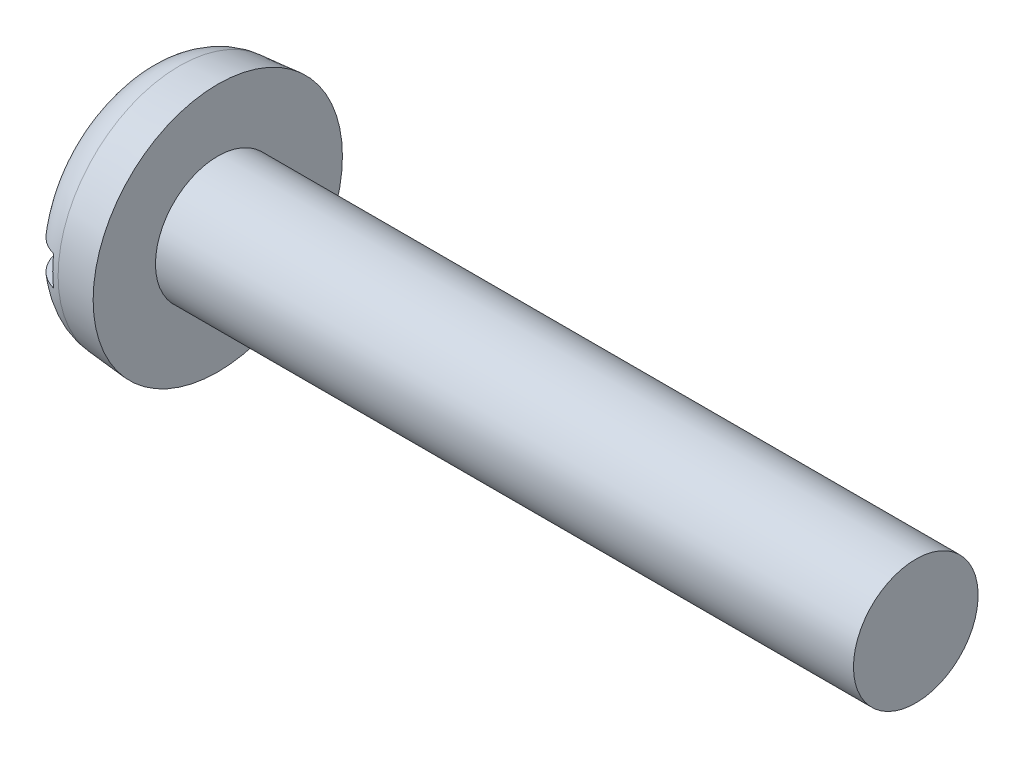
ISO-10303-21;
HEADER;
FILE_DESCRIPTION(('STEP AP214'),'2;1');
FILE_NAME('part.step','',(''),(''),'','','');
FILE_SCHEMA(('AUTOMOTIVE_DESIGN { 1 0 10303 214 1 1 1 1 }'));
ENDSEC;
DATA;
#1=APPLICATION_CONTEXT('core data for automotive mechanical design processes');
#2=APPLICATION_PROTOCOL_DEFINITION('international standard','automotive_design',2000,#1);
#3=PRODUCT_CONTEXT('',#1,'mechanical');
#4=PRODUCT('Part','Part','',(#3));
#5=PRODUCT_RELATED_PRODUCT_CATEGORY('part','',(#4));
#6=PRODUCT_DEFINITION_FORMATION('','',#4);
#7=PRODUCT_DEFINITION_CONTEXT('part definition',#1,'design');
#8=PRODUCT_DEFINITION('design','',#6,#7);
#9=PRODUCT_DEFINITION_SHAPE('','',#8);
#10=(LENGTH_UNIT() NAMED_UNIT(*) SI_UNIT(.MILLI.,.METRE.));
#11=(NAMED_UNIT(*) PLANE_ANGLE_UNIT() SI_UNIT($,.RADIAN.));
#12=(NAMED_UNIT(*) SI_UNIT($,.STERADIAN.) SOLID_ANGLE_UNIT());
#13=UNCERTAINTY_MEASURE_WITH_UNIT(LENGTH_MEASURE(1.E-05),#10,'distance_accuracy_value','');
#14=(GEOMETRIC_REPRESENTATION_CONTEXT(3) GLOBAL_UNCERTAINTY_ASSIGNED_CONTEXT((#13)) GLOBAL_UNIT_ASSIGNED_CONTEXT((#10,
#11,#12)) REPRESENTATION_CONTEXT('',''));
#15=CARTESIAN_POINT('',(0.,0.,0.));
#16=DIRECTION('',(0.,0.,1.));
#17=DIRECTION('',(1.,0.,0.));
#18=AXIS2_PLACEMENT_3D('',#15,#16,#17);
#19=CARTESIAN_POINT('',(0.,0.,0.));
#20=DIRECTION('',(-1.,0.,0.));
#21=DIRECTION('',(0.,0.,1.));
#22=AXIS2_PLACEMENT_3D('',#19,#20,#21);
#23=PLANE('',#22);
#24=DIRECTION('',(0.,0.,-1.));
#25=VECTOR('',#24,1.);
#26=CARTESIAN_POINT('',(0.,0.3,2.5));
#27=LINE('',#26,#25);
#28=CARTESIAN_POINT('',(0.,0.3,1.60795561103897));
#29=VERTEX_POINT('',#28);
#30=CARTESIAN_POINT('',(0.,0.3,-1.60795561103897));
#31=VERTEX_POINT('',#30);
#32=EDGE_CURVE('E88',#29,#31,#27,.T.);
#33=ORIENTED_EDGE('',*,*,#32,.F.);
#34=CARTESIAN_POINT('',(0.,0.,0.));
#35=DIRECTION('',(-1.,0.,0.));
#36=DIRECTION('',(0.,0.,1.));
#37=AXIS2_PLACEMENT_3D('',#34,#35,#36);
#38=CIRCLE('',#37,1.63570206549717);
#39=EDGE_CURVE('E94',#29,#31,#38,.T.);
#40=ORIENTED_EDGE('',*,*,#39,.T.);
#41=EDGE_LOOP('',(#33,#40));
#42=FACE_BOUND('',#41,.T.);
#43=ADVANCED_FACE('F35',(#42),#23,.T.);
#44=CARTESIAN_POINT('',(-25.4,0.,0.));
#45=DIRECTION('',(-1.,0.,0.));
#46=DIRECTION('',(0.,0.,1.));
#47=AXIS2_PLACEMENT_3D('',#44,#45,#46);
#48=CYLINDRICAL_SURFACE('',#47,1.25);
#49=CARTESIAN_POINT('',(15.5,0.,0.));
#50=DIRECTION('',(-1.,0.,0.));
#51=DIRECTION('',(0.,0.,1.));
#52=AXIS2_PLACEMENT_3D('',#49,#50,#51);
#53=CIRCLE('',#52,1.25);
#54=CARTESIAN_POINT('',(15.5,0.,1.25));
#55=VERTEX_POINT('',#54);
#56=EDGE_CURVE('E95',#55,#55,#53,.T.);
#57=ORIENTED_EDGE('',*,*,#56,.T.);
#58=EDGE_LOOP('',(#57));
#59=FACE_BOUND('',#58,.T.);
#60=CARTESIAN_POINT('',(1.5,0.,0.));
#61=DIRECTION('',(-1.,0.,0.));
#62=DIRECTION('',(0.,0.,1.));
#63=AXIS2_PLACEMENT_3D('',#60,#61,#62);
#64=CIRCLE('',#63,1.25);
#65=CARTESIAN_POINT('',(1.5,0.,1.25));
#66=VERTEX_POINT('',#65);
#67=EDGE_CURVE('E152',#66,#66,#64,.T.);
#68=ORIENTED_EDGE('',*,*,#67,.F.);
#69=EDGE_LOOP('',(#68));
#70=FACE_BOUND('',#69,.T.);
#71=ADVANCED_FACE('F140',(#59,#70),#48,.T.);
#72=CARTESIAN_POINT('',(15.5,1.25,0.));
#73=DIRECTION('',(1.,0.,0.));
#74=DIRECTION('',(0.,0.,-1.));
#75=AXIS2_PLACEMENT_3D('',#72,#73,#74);
#76=PLANE('',#75);
#77=ORIENTED_EDGE('',*,*,#56,.F.);
#78=EDGE_LOOP('',(#77));
#79=FACE_BOUND('',#78,.T.);
#80=ADVANCED_FACE('F138',(#79),#76,.T.);
#81=DIRECTION('',(0.,0.,1.));
#82=VECTOR('',#81,1.);
#83=CARTESIAN_POINT('',(0.,-0.3,-2.5));
#84=LINE('',#83,#82);
#85=CARTESIAN_POINT('',(0.,-0.3,-1.60795561103897));
#86=VERTEX_POINT('',#85);
#87=CARTESIAN_POINT('',(0.,-0.3,1.60795561103897));
#88=VERTEX_POINT('',#87);
#89=EDGE_CURVE('E79',#86,#88,#84,.T.);
#90=ORIENTED_EDGE('',*,*,#89,.F.);
#91=EDGE_CURVE('E86',#86,#88,#38,.T.);
#92=ORIENTED_EDGE('',*,*,#91,.T.);
#93=EDGE_LOOP('',(#90,#92));
#94=FACE_BOUND('',#93,.T.);
#95=ADVANCED_FACE('F85',(#94),#23,.T.);
#96=CARTESIAN_POINT('',(0.,0.,0.));
#97=DIRECTION('',(1.,0.,0.));
#98=DIRECTION('',(0.,0.,-1.));
#99=AXIS2_PLACEMENT_3D('',#96,#97,#98);
#100=CONICAL_SURFACE('',#99,2.36876700471111,0.0872664625997168);
#101=CARTESIAN_POINT('',(0.730275405801877,0.,0.));
#102=DIRECTION('',(-1.,0.,0.));
#103=DIRECTION('',(0.,0.,1.));
#104=AXIS2_PLACEMENT_3D('',#101,#102,#103);
#105=CIRCLE('',#104,2.43265782397057);
#106=CARTESIAN_POINT('',(0.730275405801877,0.,2.43265782397057));
#107=VERTEX_POINT('',#106);
#108=EDGE_CURVE('E98',#107,#107,#105,.F.);
#109=ORIENTED_EDGE('',*,*,#108,.T.);
#110=EDGE_LOOP('',(#109));
#111=FACE_BOUND('',#110,.T.);
#112=CARTESIAN_POINT('',(1.5,0.,0.));
#113=DIRECTION('',(-1.,0.,0.));
#114=DIRECTION('',(0.,0.,1.));
#115=AXIS2_PLACEMENT_3D('',#112,#113,#114);
#116=CIRCLE('',#115,2.5);
#117=CARTESIAN_POINT('',(1.5,0.,2.5));
#118=VERTEX_POINT('',#117);
#119=EDGE_CURVE('E100',#118,#118,#116,.T.);
#120=ORIENTED_EDGE('',*,*,#119,.T.);
#121=EDGE_LOOP('',(#120));
#122=FACE_BOUND('',#121,.T.);
#123=ADVANCED_FACE('F131',(#111,#122),#100,.T.);
#124=CARTESIAN_POINT('',(1.5,1.25,0.));
#125=DIRECTION('',(-1.,0.,0.));
#126=DIRECTION('',(0.,0.,1.));
#127=AXIS2_PLACEMENT_3D('',#124,#125,#126);
#128=PLANE('',#127);
#129=ORIENTED_EDGE('',*,*,#119,.F.);
#130=EDGE_LOOP('',(#129));
#131=FACE_BOUND('',#130,.T.);
#132=ORIENTED_EDGE('',*,*,#67,.T.);
#133=EDGE_LOOP('',(#132));
#134=FACE_BOUND('',#133,.T.);
#135=ADVANCED_FACE('F127',(#131,#134),#128,.F.);
#136=CARTESIAN_POINT('',(0.8,0.,0.));
#137=DIRECTION('',(-1.,0.,0.));
#138=DIRECTION('',(0.,0.,1.));
#139=AXIS2_PLACEMENT_3D('',#136,#137,#138);
#140=TOROIDAL_SURFACE('',#139,1.63570206549717,0.8);
#141=CARTESIAN_POINT('',(0.346271954825906,0.3,-2.27489224770811));
#142=CARTESIAN_POINT('',(0.382981221291911,0.3,-2.30038780568684));
#143=CARTESIAN_POINT('',(0.421862088629287,0.3,-2.32281215243494));
#144=CARTESIAN_POINT('',(0.502867013421401,0.3,-2.36083712946197));
#145=CARTESIAN_POINT('',(0.544994734997337,0.3,-2.37642991360695));
#146=CARTESIAN_POINT('',(0.631262486448076,0.3,-2.40030719215208));
#147=CARTESIAN_POINT('',(0.675401850508367,0.3,-2.4085940864482));
#148=CARTESIAN_POINT('',(0.764434268095194,0.3,-2.41762015842896));
#149=CARTESIAN_POINT('',(0.809327138447646,0.3,-2.41836114461722));
#150=CARTESIAN_POINT('',(0.89851124904464,0.3,-2.41228527526171));
#151=CARTESIAN_POINT('',(0.942803482555131,0.3,-2.40548299197619));
#152=CARTESIAN_POINT('',(1.02961935476443,0.3,-2.38454240000312));
#153=CARTESIAN_POINT('',(1.07214293797187,0.3,-2.370403861328));
#154=CARTESIAN_POINT('',(1.15424251103958,0.3,-2.33519334266129));
#155=CARTESIAN_POINT('',(1.19381686044806,0.3,-2.31411753874067));
#156=CARTESIAN_POINT('',(1.2688841876096,0.3,-2.26564701061651));
#157=CARTESIAN_POINT('',(1.30437712286777,0.3,-2.23825222062987));
#158=CARTESIAN_POINT('',(1.37043907095105,0.3,-2.17780800215776));
#159=CARTESIAN_POINT('',(1.40098706166943,0.3,-2.14473560311701));
#160=CARTESIAN_POINT('',(1.45614881362635,0.3,-2.07396717898998));
#161=CARTESIAN_POINT('',(1.48076240824163,0.3,-2.03627102412481));
#162=CARTESIAN_POINT('',(1.52357911601004,0.3,-1.95700639404151));
#163=CARTESIAN_POINT('',(1.54172900563642,0.3,-1.91540917787504));
#164=CARTESIAN_POINT('',(1.57088147170011,0.3,-1.82978316773323));
#165=CARTESIAN_POINT('',(1.58188367445618,0.3,-1.78575424675885));
#166=CARTESIAN_POINT('',(1.59658454231858,0.3,-1.69593641892494));
#167=CARTESIAN_POINT('',(1.60019140340234,0.3,-1.6501324981032));
#168=CARTESIAN_POINT('',(1.59979285769417,0.3,-1.55855920815004));
#169=CARTESIAN_POINT('',(1.59578684482663,0.3,-1.51278984205981));
#170=CARTESIAN_POINT('',(1.58020985485379,0.3,-1.42179813537146));
#171=CARTESIAN_POINT('',(1.56851806377669,0.3,-1.37659648110366));
#172=CARTESIAN_POINT('',(1.53783036526708,0.3,-1.28874379544071));
#173=CARTESIAN_POINT('',(1.51883368929496,0.3,-1.24609303296809));
#174=CARTESIAN_POINT('',(1.47373329815327,0.3,-1.16386201547514));
#175=CARTESIAN_POINT('',(1.44752374988909,0.3,-1.12433976059046));
#176=CARTESIAN_POINT('',(1.38884813961775,0.3,-1.05023672784233));
#177=CARTESIAN_POINT('',(1.35638113258177,0.3,-1.01565669775085));
#178=CARTESIAN_POINT('',(1.28601118967412,0.3,-0.952477446973463));
#179=CARTESIAN_POINT('',(1.24810362553732,0.3,-0.923883369963329));
#180=CARTESIAN_POINT('',(1.16787721264646,0.3,-0.873741742015428));
#181=CARTESIAN_POINT('',(1.12555948100713,0.3,-0.852192412306086));
#182=CARTESIAN_POINT('',(1.03934163259914,0.3,-0.817733148032031));
#183=CARTESIAN_POINT('',(0.995557654344731,0.3,-0.804533569495742));
#184=CARTESIAN_POINT('',(0.906338217846426,0.3,-0.786217541377401));
#185=CARTESIAN_POINT('',(0.860903709425568,0.3,-0.781096515950567));
#186=CARTESIAN_POINT('',(0.772644418577485,0.3,-0.779275202634231));
#187=CARTESIAN_POINT('',(0.729829104073037,0.3,-0.782081372141165));
#188=CARTESIAN_POINT('',(0.645298781282728,0.3,-0.794919458445398));
#189=CARTESIAN_POINT('',(0.60358382265832,0.3,-0.804951700794631));
#190=CARTESIAN_POINT('',(0.522755202906561,0.3,-0.831653110766294));
#191=CARTESIAN_POINT('',(0.483621978303794,0.3,-0.848263452037693));
#192=CARTESIAN_POINT('',(0.408488940070577,0.3,-0.88747989564979));
#193=CARTESIAN_POINT('',(0.372489839258651,0.3,-0.910087357255886));
#194=CARTESIAN_POINT('',(0.302545375250516,0.3,-0.96197191791226));
#195=CARTESIAN_POINT('',(0.268820912090799,0.3,-0.991546795518808));
#196=CARTESIAN_POINT('',(0.20652306876577,0.3,-1.05569931841836));
#197=CARTESIAN_POINT('',(0.177950869257488,0.3,-1.09027810710905));
#198=CARTESIAN_POINT('',(0.125389994888267,0.3,-1.16530900740793));
#199=CARTESIAN_POINT('',(0.10169158142138,0.3,-1.20596489415378));
#200=CARTESIAN_POINT('',(0.0613679525136922,0.3,-1.29064757645666));
#201=CARTESIAN_POINT('',(0.0447433533595434,0.3,-1.33467466532629));
#202=CARTESIAN_POINT('',(0.0189309401556088,0.3,-1.42538421333081));
#203=CARTESIAN_POINT('',(0.00982642971068213,0.3,-1.47209044323813));
#204=CARTESIAN_POINT('',(-0.000307624484262301,0.3,-1.56637102065331));
#205=CARTESIAN_POINT('',(-0.0013378540176064,0.3,-1.61394529409048));
#206=CARTESIAN_POINT('',(0.00473948803241732,0.3,-1.70798673706294));
#207=CARTESIAN_POINT('',(0.0117474287687578,0.3,-1.75446032879794));
#208=CARTESIAN_POINT('',(0.0336065367957765,0.3,-1.84553978176653));
#209=CARTESIAN_POINT('',(0.0484590123719668,0.3,-1.89014533011436));
#210=CARTESIAN_POINT('',(0.0853133773946965,0.3,-1.97542169751855));
#211=CARTESIAN_POINT('',(0.107193614955137,0.3,-2.01614518054492));
#212=CARTESIAN_POINT('',(0.157559963366541,0.3,-2.09323006323882));
#213=CARTESIAN_POINT('',(0.18603737589317,0.3,-2.12959711187254));
#214=CARTESIAN_POINT('',(0.236809213221316,0.3,-2.18407387883572));
#215=CARTESIAN_POINT('',(0.257331725756588,0.3,-2.20386432475386));
#216=CARTESIAN_POINT('',(0.300366178708034,0.3,-2.24114967581062));
#217=CARTESIAN_POINT('',(0.322878103883696,0.3,-2.25864459853225));
#218=CARTESIAN_POINT('',(0.346271954825906,0.3,-2.27489224770811));
#219=B_SPLINE_CURVE_WITH_KNOTS('',3,(#141,#142,#143,#144,#145,#146,#147,#148,#149,#150,#151,
#152,#153,#154,#155,#156,#157,#158,#159,#160,#161,#162,#163,#164,#165,#166,#167,#168,#169,#170,
#171,#172,#173,#174,#175,#176,#177,#178,#179,#180,#181,#182,#183,#184,#185,#186,#187,#188,#189,
#190,#191,#192,#193,#194,#195,#196,#197,#198,#199,#200,#201,#202,#203,#204,#205,#206,#207,#208,
#209,#210,#211,#212,#213,#214,#215,#216,#217,#218),.UNSPECIFIED.,.T.,.F.,(4,2,2,2,2,2,2,2,2,2,2,
2,2,2,2,2,2,2,2,2,2,2,2,2,2,2,2,2,2,2,2,2,2,2,2,2,2,2,4),(0.,0.133979836981273,
0.268113150636835,0.402202386695446,0.536259485259754,0.67005805974364,0.80386082899284,
0.937737476277393,1.07161551733302,1.20604855068384,1.34048535814448,1.47600485844888,
1.61153144314583,1.74873047958834,1.88594043916878,2.0253605206583,2.16479527440948,
2.30639635731519,2.44801884221736,2.58976252700642,2.73147039436812,2.86794537982788,
3.0043430354916,3.13243910150612,3.26054093891704,3.3875221642773,3.51453219494223,
3.64850763446042,3.78251373595534,3.92303281987705,4.06356414363279,4.20563207807678,
4.34768794595067,4.48800192421954,4.62833931098122,4.76636769003467,4.90421510521554,
4.98959758889762,5.07497941853739),.UNSPECIFIED.);
#220=CARTESIAN_POINT('',(0.6,0.3,-2.39155597690766));
#221=VERTEX_POINT('',#220);
#222=EDGE_CURVE('E11',#31,#221,#219,.T.);
#223=ORIENTED_EDGE('',*,*,#222,.F.);
#224=ORIENTED_EDGE('',*,*,#39,.F.);
#225=CARTESIAN_POINT('',(0.281026360706062,0.3,0.982078952792831));
#226=CARTESIAN_POINT('',(0.314354178955322,0.3,0.952375090769076));
#227=CARTESIAN_POINT('',(0.350099467061479,0.3,0.925347748168898));
#228=CARTESIAN_POINT('',(0.425580028676774,0.3,0.877525332269945));
#229=CARTESIAN_POINT('',(0.465318248443554,0.3,0.856734906748651));
#230=CARTESIAN_POINT('',(0.547861892097658,0.3,0.822173940504009));
#231=CARTESIAN_POINT('',(0.590673981156459,0.3,0.808419213930325));
#232=CARTESIAN_POINT('',(0.678040821362311,0.3,0.788671121431665));
#233=CARTESIAN_POINT('',(0.722594558167156,0.3,0.782673305239669));
#234=CARTESIAN_POINT('',(0.81014760809469,0.3,0.778838019604097));
#235=CARTESIAN_POINT('',(0.853132429090197,0.3,0.780664295231913));
#236=CARTESIAN_POINT('',(0.938158471913555,0.3,0.791622665432216));
#237=CARTESIAN_POINT('',(0.980199634623023,0.3,0.800755216422827));
#238=CARTESIAN_POINT('',(1.06161537625992,0.3,0.825718283497641));
#239=CARTESIAN_POINT('',(1.10101803009067,0.3,0.841457894797744));
#240=CARTESIAN_POINT('',(1.1768163966382,0.3,0.879000026460196));
#241=CARTESIAN_POINT('',(1.21321143992362,0.3,0.900803891909537));
#242=CARTESIAN_POINT('',(1.28400997433102,0.3,0.951062635911344));
#243=CARTESIAN_POINT('',(1.31820773053853,0.3,0.97980724337675));
#244=CARTESIAN_POINT('',(1.38158997003389,0.3,1.04237496803779));
#245=CARTESIAN_POINT('',(1.41077329888382,0.3,1.0761992513431));
#246=CARTESIAN_POINT('',(1.46477772932318,0.3,1.14985599620833));
#247=CARTESIAN_POINT('',(1.48930249992633,0.3,1.18990618044539));
#248=CARTESIAN_POINT('',(1.53138552305256,0.3,1.27351581640187));
#249=CARTESIAN_POINT('',(1.54894309382699,0.3,1.31707561103932));
#250=CARTESIAN_POINT('',(1.57675111461742,0.3,1.40710502040913));
#251=CARTESIAN_POINT('',(1.58690206882601,0.3,1.45360545096325));
#252=CARTESIAN_POINT('',(1.59915672094623,0.3,1.54765684155552));
#253=CARTESIAN_POINT('',(1.60126074603491,0.3,1.59520775880326));
#254=CARTESIAN_POINT('',(1.59731118473586,0.3,1.68943295053895));
#255=CARTESIAN_POINT('',(1.59134955004231,0.3,1.73611105835168));
#256=CARTESIAN_POINT('',(1.57153533448125,0.3,1.82776260025589));
#257=CARTESIAN_POINT('',(1.55768343439129,0.3,1.87273618105814));
#258=CARTESIAN_POINT('',(1.52274090896722,0.3,1.95888880905096));
#259=CARTESIAN_POINT('',(1.5017770552228,0.3,2.00011928068252));
#260=CARTESIAN_POINT('',(1.45312873810197,0.3,2.07840468156623));
#261=CARTESIAN_POINT('',(1.42544481035863,0.3,2.11545994326493));
#262=CARTESIAN_POINT('',(1.36457509906943,0.3,2.1837889621313));
#263=CARTESIAN_POINT('',(1.33147329150196,0.3,2.21513754587091));
#264=CARTESIAN_POINT('',(1.2604315701033,0.3,2.27176565181173));
#265=CARTESIAN_POINT('',(1.22249193186608,0.3,2.29704551948978));
#266=CARTESIAN_POINT('',(1.14325429201782,0.3,2.34056706972702));
#267=CARTESIAN_POINT('',(1.10199272346574,0.3,2.35887510295715));
#268=CARTESIAN_POINT('',(1.01697043170674,0.3,2.38826000310028));
#269=CARTESIAN_POINT('',(0.973209796416715,0.3,2.39933712422574));
#270=CARTESIAN_POINT('',(0.884693384093041,0.3,2.41389181799488));
#271=CARTESIAN_POINT('',(0.83994449864403,0.3,2.41741133094409));
#272=CARTESIAN_POINT('',(0.750492728595219,0.3,2.41687246140275));
#273=CARTESIAN_POINT('',(0.705789843275126,0.3,2.41281419943257));
#274=CARTESIAN_POINT('',(0.617784485907429,0.3,2.39725349116876));
#275=CARTESIAN_POINT('',(0.574479593773359,0.3,2.38576472376352));
#276=CARTESIAN_POINT('',(0.490408740717999,0.3,2.35569171268885));
#277=CARTESIAN_POINT('',(0.449642779592388,0.3,2.33710746959042));
#278=CARTESIAN_POINT('',(0.371728180770502,0.3,2.29334676277467));
#279=CARTESIAN_POINT('',(0.334585742751966,0.3,2.26815926350586));
#280=CARTESIAN_POINT('',(0.265028872482624,0.3,2.21193666372137));
#281=CARTESIAN_POINT('',(0.232614526934962,0.3,2.18090145599508));
#282=CARTESIAN_POINT('',(0.173240600189447,0.3,2.11369494256949));
#283=CARTESIAN_POINT('',(0.14631103560085,0.3,2.07749712503553));
#284=CARTESIAN_POINT('',(0.0988465105382838,0.3,2.00112875696665));
#285=CARTESIAN_POINT('',(0.0783118042936199,0.3,1.96095804857202));
#286=CARTESIAN_POINT('',(0.0440026431554678,0.3,1.87738549110236));
#287=CARTESIAN_POINT('',(0.030293562767096,0.3,1.83395681404383));
#288=CARTESIAN_POINT('',(0.0102546647714594,0.3,1.74543259751495));
#289=CARTESIAN_POINT('',(0.00392500328610574,0.3,1.70033702279988));
#290=CARTESIAN_POINT('',(-0.00127868823678431,0.3,1.60910380364306));
#291=CARTESIAN_POINT('',(-5.02028189759461E-05,0.3,1.56296032667787));
#292=CARTESIAN_POINT('',(0.0100041677465169,0.3,1.47149846329319));
#293=CARTESIAN_POINT('',(0.0188324041150211,0.3,1.42618033665294));
#294=CARTESIAN_POINT('',(0.044001474695557,0.3,1.33684519637754));
#295=CARTESIAN_POINT('',(0.0604683963706463,0.3,1.29286376374974));
#296=CARTESIAN_POINT('',(0.100448703224044,0.3,1.20826526027377));
#297=CARTESIAN_POINT('',(0.123955682056375,0.3,1.16764517336159));
#298=CARTESIAN_POINT('',(0.169401603069976,0.3,1.10229383741319));
#299=CARTESIAN_POINT('',(0.189731251233043,0.3,1.07642764082274));
#300=CARTESIAN_POINT('',(0.233279554215512,0.3,1.02725068057828));
#301=CARTESIAN_POINT('',(0.256498252852413,0.3,1.00393995569256));
#302=CARTESIAN_POINT('',(0.281026360706062,0.3,0.982078952792831));
#303=B_SPLINE_CURVE_WITH_KNOTS('',3,(#225,#226,#227,#228,#229,#230,#231,#232,#233,#234,#235,
#236,#237,#238,#239,#240,#241,#242,#243,#244,#245,#246,#247,#248,#249,#250,#251,#252,#253,#254,
#255,#256,#257,#258,#259,#260,#261,#262,#263,#264,#265,#266,#267,#268,#269,#270,#271,#272,#273,
#274,#275,#276,#277,#278,#279,#280,#281,#282,#283,#284,#285,#286,#287,#288,#289,#290,#291,#292,
#293,#294,#295,#296,#297,#298,#299,#300,#301,#302),.UNSPECIFIED.,.T.,.F.,(4,2,2,2,2,2,2,2,2,2,2,
2,2,2,2,2,2,2,2,2,2,2,2,2,2,2,2,2,2,2,2,2,2,2,2,2,2,2,4),(0.,0.133820291005088,
0.267740059150158,0.401959530617103,0.536101963956761,0.664538543931332,0.792983147879539,
0.919715619370027,1.04647622331141,1.17991059488131,1.31337564510913,1.45361011867398,
1.59385831096472,1.73595746502875,1.87805084147565,2.01853787337557,2.15901278579286,
2.2971049079012,2.43518602679258,2.57130052215589,2.7074072670225,2.84218423570159,
2.97695646585954,3.11097883514798,3.24499907290224,3.37877329107656,3.51254749848545,
3.64654671438815,3.7805483872422,3.91526479400885,4.04998655577882,4.1859749603,
4.32196624179356,4.45980608001397,4.59768857863513,4.73793275953154,4.87804970611454,
4.97653526308118,5.07502231393553),.UNSPECIFIED.);
#304=CARTESIAN_POINT('',(0.6,0.3,2.39155597690766));
#305=VERTEX_POINT('',#304);
#306=EDGE_CURVE('E112',#305,#29,#303,.T.);
#307=ORIENTED_EDGE('',*,*,#306,.F.);
#308=CARTESIAN_POINT('',(0.6,0.,0.));
#309=DIRECTION('',(-1.,0.,0.));
#310=DIRECTION('',(0.,0.,1.));
#311=AXIS2_PLACEMENT_3D('',#308,#309,#310);
#312=CIRCLE('',#311,2.41029873473866);
#313=CARTESIAN_POINT('',(0.6,-0.3,2.39155597690766));
#314=VERTEX_POINT('',#313);
#315=EDGE_CURVE('E106',#305,#314,#312,.F.);
#316=ORIENTED_EDGE('',*,*,#315,.T.);
#317=CARTESIAN_POINT('',(0.281026360706061,-0.3,0.982078952792831));
#318=CARTESIAN_POINT('',(0.245774843768734,-0.3,1.01350112144884));
#319=CARTESIAN_POINT('',(0.213178490241833,-0.3,1.04796467024837));
#320=CARTESIAN_POINT('',(0.15419008476588,-0.3,1.12190525192631));
#321=CARTESIAN_POINT('',(0.127808276563441,-0.3,1.16139039948827));
#322=CARTESIAN_POINT('',(0.0820348730300808,-0.3,1.2441904040669));
#323=CARTESIAN_POINT('',(0.0626378546769478,-0.3,1.28750225733107));
#324=CARTESIAN_POINT('',(0.0313941530285136,-0.3,1.37675013678228));
#325=CARTESIAN_POINT('',(0.0195444029741543,-0.3,1.42268508882028));
#326=CARTESIAN_POINT('',(0.00377412178005066,-0.3,1.51592277992961));
#327=CARTESIAN_POINT('',(-0.000142695773255692,-0.3,1.56322614908387));
#328=CARTESIAN_POINT('',(0.000150637788190008,-0.3,1.65781319394767));
#329=CARTESIAN_POINT('',(0.00436088181432025,-0.3,1.70509686942588));
#330=CARTESIAN_POINT('',(0.0207288491908996,-0.3,1.79752651469366));
#331=CARTESIAN_POINT('',(0.0327646384666442,-0.3,1.84269406701544));
#332=CARTESIAN_POINT('',(0.064375147144429,-0.3,1.93030984731099));
#333=CARTESIAN_POINT('',(0.0839491382691289,-0.3,1.97275833751563));
#334=CARTESIAN_POINT('',(0.129726094612331,-0.3,2.05299347586234));
#335=CARTESIAN_POINT('',(0.155815130904534,-0.3,2.09084513839145));
#336=CARTESIAN_POINT('',(0.214052656526274,-0.3,2.16155869630011));
#337=CARTESIAN_POINT('',(0.246200706900852,-0.3,2.19442095283395));
#338=CARTESIAN_POINT('',(0.315203079015367,-0.3,2.25379408496923));
#339=CARTESIAN_POINT('',(0.351993348521588,-0.3,2.28037941945029));
#340=CARTESIAN_POINT('',(0.429544384479721,-0.3,2.32693684278657));
#341=CARTESIAN_POINT('',(0.470304964554109,-0.3,2.34690924187812));
#342=CARTESIAN_POINT('',(0.554283270776541,-0.3,2.3795139091618));
#343=CARTESIAN_POINT('',(0.597478499888427,-0.3,2.39220414155814));
#344=CARTESIAN_POINT('',(0.685390071282204,-0.3,2.41011952269426));
#345=CARTESIAN_POINT('',(0.730106371069983,-0.3,2.415344879805));
#346=CARTESIAN_POINT('',(0.819596302962012,-0.3,2.418170886719));
#347=CARTESIAN_POINT('',(0.864368961129586,-0.3,2.41580248023995));
#348=CARTESIAN_POINT('',(0.952879725326683,-0.3,2.40357839484384));
#349=CARTESIAN_POINT('',(0.996617841019351,-0.3,2.3937227858895));
#350=CARTESIAN_POINT('',(1.08179980105852,-0.3,2.36681894835771));
#351=CARTESIAN_POINT('',(1.12324470052076,-0.3,2.34977405924718));
#352=CARTESIAN_POINT('',(1.20269634236487,-0.3,2.30898855994902));
#353=CARTESIAN_POINT('',(1.2407030607413,-0.3,2.2852479030162));
#354=CARTESIAN_POINT('',(1.31233075952129,-0.3,2.23167549071489));
#355=CARTESIAN_POINT('',(1.34593793153999,-0.3,2.20182527749964));
#356=CARTESIAN_POINT('',(1.40770458428112,-0.3,2.13694073144684));
#357=CARTESIAN_POINT('',(1.43586393169442,-0.3,2.10190627178696));
#358=CARTESIAN_POINT('',(1.48615164446411,-0.3,2.02739761434139));
#359=CARTESIAN_POINT('',(1.50823734524675,-0.3,1.9878946291007));
#360=CARTESIAN_POINT('',(1.54554445467102,-0.3,1.90577219016714));
#361=CARTESIAN_POINT('',(1.56076556139964,-0.3,1.86315259949804));
#362=CARTESIAN_POINT('',(1.58410272400605,-0.3,1.77550644253182));
#363=CARTESIAN_POINT('',(1.59213833857652,-0.3,1.73045846894919));
#364=CARTESIAN_POINT('',(1.60065353042368,-0.3,1.63965552614572));
#365=CARTESIAN_POINT('',(1.6011325624022,-0.3,1.59390050614148));
#366=CARTESIAN_POINT('',(1.5945353460195,-0.3,1.5022403872565));
#367=CARTESIAN_POINT('',(1.5873442284516,-0.3,1.45634356502453));
#368=CARTESIAN_POINT('',(1.56548831653362,-0.3,1.36636575700329));
#369=CARTESIAN_POINT('',(1.55082281704101,-0.3,1.32228494296267));
#370=CARTESIAN_POINT('',(1.5141590801731,-0.3,1.23641727300187));
#371=CARTESIAN_POINT('',(1.49204319029973,-0.3,1.19468062738119));
#372=CARTESIAN_POINT('',(1.44117046081713,-0.3,1.11546410031307));
#373=CARTESIAN_POINT('',(1.41241262281435,-0.3,1.07798486008817));
#374=CARTESIAN_POINT('',(1.34878284077197,-0.3,1.00810942028702));
#375=CARTESIAN_POINT('',(1.31386684076754,-0.3,0.975753270791351));
#376=CARTESIAN_POINT('',(1.23898299657705,-0.3,0.917520165892692));
#377=CARTESIAN_POINT('',(1.19901544006532,-0.3,0.891642841785685));
#378=CARTESIAN_POINT('',(1.11612436063624,-0.3,0.847908522257759));
#379=CARTESIAN_POINT('',(1.07329495602511,-0.3,0.829873730498215));
#380=CARTESIAN_POINT('',(0.985103689636777,-0.3,0.801780797928901));
#381=CARTESIAN_POINT('',(0.939743494448851,-0.3,0.791717472550925));
#382=CARTESIAN_POINT('',(0.850720205826478,-0.3,0.780460519378402));
#383=CARTESIAN_POINT('',(0.807119819003581,-0.3,0.778768420736191));
#384=CARTESIAN_POINT('',(0.720281074819165,-0.3,0.782994419533882));
#385=CARTESIAN_POINT('',(0.677042768453712,-0.3,0.78891357139743));
#386=CARTESIAN_POINT('',(0.593531964331984,-0.3,0.807756953313506));
#387=CARTESIAN_POINT('',(0.553209201284071,-0.3,0.82046132769388));
#388=CARTESIAN_POINT('',(0.475168345201466,-0.3,0.852178551219281));
#389=CARTESIAN_POINT('',(0.43744772558635,-0.3,0.871185173933198));
#390=CARTESIAN_POINT('',(0.380074487578562,-0.3,0.905956185136767));
#391=CARTESIAN_POINT('',(0.359299157313722,-0.3,0.919908625127631));
#392=CARTESIAN_POINT('',(0.31910978658257,-0.3,0.949649375004985));
#393=CARTESIAN_POINT('',(0.299695712697072,-0.3,0.965437639796203));
#394=CARTESIAN_POINT('',(0.281026360706061,-0.3,0.982078952792831));
#395=B_SPLINE_CURVE_WITH_KNOTS('',3,(#317,#318,#319,#320,#321,#322,#323,#324,#325,#326,#327,
#328,#329,#330,#331,#332,#333,#334,#335,#336,#337,#338,#339,#340,#341,#342,#343,#344,#345,#346,
#347,#348,#349,#350,#351,#352,#353,#354,#355,#356,#357,#358,#359,#360,#361,#362,#363,#364,#365,
#366,#367,#368,#369,#370,#371,#372,#373,#374,#375,#376,#377,#378,#379,#380,#381,#382,#383,#384,
#385,#386,#387,#388,#389,#390,#391,#392,#393,#394),.UNSPECIFIED.,.T.,.F.,(4,2,2,2,2,2,2,2,2,2,2,
2,2,2,2,2,2,2,2,2,2,2,2,2,2,2,2,2,2,2,2,2,2,2,2,2,2,2,4),(0.,0.141576563675931,
0.283384887159893,0.425082871420505,0.566723241288097,0.708429900928827,0.850138180618685,
0.989689692875919,1.12922772622657,1.26647831208684,1.40371895842849,1.53923909856248,
1.67475288006372,1.80917248510556,1.94358833794945,2.07745715875452,2.21132472866349,
2.34513018458606,2.4789365746684,2.61315334363977,2.74737339650151,2.88251350597148,
3.01765955848441,3.15430028174201,3.29095086522366,3.42967706218518,3.56841634917276,
3.70945810590195,3.85052107733031,3.99263749896477,4.13474583104454,4.27343908043648,
4.41204205078398,4.54228329281362,4.67254257974162,4.79881667821866,4.92496639157744,
4.99994777804627,5.07492732305827),.UNSPECIFIED.);
#396=EDGE_CURVE('E93',#88,#314,#395,.T.);
#397=ORIENTED_EDGE('',*,*,#396,.F.);
#398=ORIENTED_EDGE('',*,*,#91,.F.);
#399=CARTESIAN_POINT('',(0.346271954825906,-0.3,-2.27489224770811));
#400=CARTESIAN_POINT('',(0.309188690216345,-0.3,-2.24913193733481));
#401=CARTESIAN_POINT('',(0.274266767796364,-0.3,-2.22019852903885));
#402=CARTESIAN_POINT('',(0.209764153722335,-0.3,-2.15683904163351));
#403=CARTESIAN_POINT('',(0.180190501610232,-0.3,-2.12240583412771));
#404=CARTESIAN_POINT('',(0.127256829990929,-0.3,-2.04910037833076));
#405=CARTESIAN_POINT('',(0.10389119100876,-0.3,-2.0102321904507));
#406=CARTESIAN_POINT('',(0.0639663174512114,-0.3,-1.92916143895838));
#407=CARTESIAN_POINT('',(0.0474053646002829,-0.3,-1.88695972032084));
#408=CARTESIAN_POINT('',(0.0213844140496326,-0.3,-1.80005045559102));
#409=CARTESIAN_POINT('',(0.0119828834645139,-0.3,-1.7553254150886));
#410=CARTESIAN_POINT('',(0.000703564015161399,-0.3,-1.66493620535775));
#411=CARTESIAN_POINT('',(-0.00117340446329579,-0.3,-1.61927193427268));
#412=CARTESIAN_POINT('',(0.00261315840919326,-0.3,-1.5275783667739));
#413=CARTESIAN_POINT('',(0.00838910437106627,-0.3,-1.48155372290125));
#414=CARTESIAN_POINT('',(0.0274543999540509,-0.3,-1.3910885774773));
#415=CARTESIAN_POINT('',(0.040744436667138,-0.3,-1.34664822118909));
#416=CARTESIAN_POINT('',(0.0747105546984445,-0.3,-1.25982496524857));
#417=CARTESIAN_POINT('',(0.0955065414146755,-0.3,-1.21748895432072));
#418=CARTESIAN_POINT('',(0.143846533808558,-0.3,-1.13685587189904));
#419=CARTESIAN_POINT('',(0.17139149569568,-0.3,-1.098559373833));
#420=CARTESIAN_POINT('',(0.232771075004686,-0.3,-1.02677365025413));
#421=CARTESIAN_POINT('',(0.266660627948662,-0.3,-0.993331323859658));
#422=CARTESIAN_POINT('',(0.339674194744559,-0.3,-0.932736383233538));
#423=CARTESIAN_POINT('',(0.378798157999943,-0.3,-0.905583708212178));
#424=CARTESIAN_POINT('',(0.460396300043438,-0.3,-0.859063641556148));
#425=CARTESIAN_POINT('',(0.502786967286522,-0.3,-0.839550238827475));
#426=CARTESIAN_POINT('',(0.590371475503019,-0.3,-0.808426326002579));
#427=CARTESIAN_POINT('',(0.635563649368746,-0.3,-0.796811164193027));
#428=CARTESIAN_POINT('',(0.72462303627091,-0.3,-0.782533271653284));
#429=CARTESIAN_POINT('',(0.768412699595354,-0.3,-0.779385806245593));
#430=CARTESIAN_POINT('',(0.855861440773314,-0.3,-0.78080885188608));
#431=CARTESIAN_POINT('',(0.899520542034917,-0.3,-0.78537788459366));
#432=CARTESIAN_POINT('',(0.983779686123574,-0.3,-0.801674930043015));
#433=CARTESIAN_POINT('',(1.02443310895885,-0.3,-0.813130315637498));
#434=CARTESIAN_POINT('',(1.10335145244627,-0.3,-0.84245955152979));
#435=CARTESIAN_POINT('',(1.14161587679481,-0.3,-0.860334730336783));
#436=CARTESIAN_POINT('',(1.21622226640048,-0.3,-0.902622140868102));
#437=CARTESIAN_POINT('',(1.25244087712099,-0.3,-0.92725159638196));
#438=CARTESIAN_POINT('',(1.32053051600652,-0.3,-0.981922617100006));
#439=CARTESIAN_POINT('',(1.35240050248336,-0.3,-1.01196547506843));
#440=CARTESIAN_POINT('',(1.41279886706702,-0.3,-1.07853677975043));
#441=CARTESIAN_POINT('',(1.44102304338686,-0.3,-1.1153416723462));
#442=CARTESIAN_POINT('',(1.49107720105431,-0.3,-1.1930716738278));
#443=CARTESIAN_POINT('',(1.51290620869496,-0.3,-1.233997408866));
#444=CARTESIAN_POINT('',(1.55003394550059,-0.3,-1.31994866267714));
#445=CARTESIAN_POINT('',(1.56515391938919,-0.3,-1.36505159452596));
#446=CARTESIAN_POINT('',(1.58755896723632,-0.3,-1.45716545476899));
#447=CARTESIAN_POINT('',(1.59484409132575,-0.3,-1.50417637095306));
#448=CARTESIAN_POINT('',(1.6012823138334,-0.3,-1.59847735823285));
#449=CARTESIAN_POINT('',(1.60048294158063,-0.3,-1.64576416615226));
#450=CARTESIAN_POINT('',(1.59081689849133,-0.3,-1.73950738308675));
#451=CARTESIAN_POINT('',(1.5819508778577,-0.3,-1.78596385872208));
#452=CARTESIAN_POINT('',(1.55656176862708,-0.3,-1.87590483809427));
#453=CARTESIAN_POINT('',(1.54016787905026,-0.3,-1.91942581173962));
#454=CARTESIAN_POINT('',(1.50019295602795,-0.3,-2.00303237704495));
#455=CARTESIAN_POINT('',(1.47661251949804,-0.3,-2.04311825367039));
#456=CARTESIAN_POINT('',(1.42333661717283,-0.3,-2.11806049249331));
#457=CARTESIAN_POINT('',(1.39374161765725,-0.3,-2.15298829208817));
#458=CARTESIAN_POINT('',(1.32904770904826,-0.3,-2.21730874983035));
#459=CARTESIAN_POINT('',(1.29394914429886,-0.3,-2.24670175402261));
#460=CARTESIAN_POINT('',(1.21967291591579,-0.3,-2.29877845647761));
#461=CARTESIAN_POINT('',(1.18054532850474,-0.3,-2.32153359642542));
#462=CARTESIAN_POINT('',(1.09900707883069,-0.3,-2.36009842437639));
#463=CARTESIAN_POINT('',(1.0565966877695,-0.3,-2.37590868539713));
#464=CARTESIAN_POINT('',(0.970014172250071,-0.3,-2.40003166193945));
#465=CARTESIAN_POINT('',(0.925856372059651,-0.3,-2.40839581979905));
#466=CARTESIAN_POINT('',(0.836750494910561,-0.3,-2.41756884122625));
#467=CARTESIAN_POINT('',(0.791802233831618,-0.3,-2.41837592054794));
#468=CARTESIAN_POINT('',(0.702528694269836,-0.3,-2.41241667625241));
#469=CARTESIAN_POINT('',(0.658202139205253,-0.3,-2.40566928208447));
#470=CARTESIAN_POINT('',(0.571350678026575,-0.3,-2.38483132094354));
#471=CARTESIAN_POINT('',(0.528823587128815,-0.3,-2.37074995211025));
#472=CARTESIAN_POINT('',(0.462961555805935,-0.3,-2.34261193113281));
#473=CARTESIAN_POINT('',(0.43867158941665,-0.3,-2.33073529780062));
#474=CARTESIAN_POINT('',(0.391420497237869,-0.3,-2.30458182279508));
#475=CARTESIAN_POINT('',(0.368459368569055,-0.3,-2.29030498632274));
#476=CARTESIAN_POINT('',(0.346271954825906,-0.3,-2.27489224770811));
#477=B_SPLINE_CURVE_WITH_KNOTS('',3,(#399,#400,#401,#402,#403,#404,#405,#406,#407,#408,#409,
#410,#411,#412,#413,#414,#415,#416,#417,#418,#419,#420,#421,#422,#423,#424,#425,#426,#427,#428,
#429,#430,#431,#432,#433,#434,#435,#436,#437,#438,#439,#440,#441,#442,#443,#444,#445,#446,#447,
#448,#449,#450,#451,#452,#453,#454,#455,#456,#457,#458,#459,#460,#461,#462,#463,#464,#465,#466,
#467,#468,#469,#470,#471,#472,#473,#474,#475,#476),.UNSPECIFIED.,.T.,.F.,(4,2,2,2,2,2,2,2,2,2,2,
2,2,2,2,2,2,2,2,2,2,2,2,2,2,2,2,2,2,2,2,2,2,2,2,2,2,2,4),(0.,0.135358146678729,
0.270893178997267,0.406305104163859,0.541682814937637,0.678154564864093,0.814641193588355,
0.953155084907578,1.09168164405076,1.2325268832658,1.37339208929138,1.51553869791902,
1.65768393263704,1.7969614940824,1.93615695601442,2.06719541319985,2.19820876864953,
2.324348597098,2.45051454392203,2.58134437156547,2.71220548393601,2.85071550380324,
2.98924660179475,3.13127467324718,3.27330183593473,3.4144944985132,3.55567578142801,
3.6945196951391,3.83335207959737,3.97003219451324,4.10670376111351,4.24184495587535,
4.37697499812699,4.51116406558358,4.6453848146297,4.7792699943163,4.91298766052578,
4.99397442755308,5.07496101909207),.UNSPECIFIED.);
#478=CARTESIAN_POINT('',(0.6,-0.3,-2.39155597690766));
#479=VERTEX_POINT('',#478);
#480=EDGE_CURVE('E47',#479,#86,#477,.T.);
#481=ORIENTED_EDGE('',*,*,#480,.F.);
#482=EDGE_CURVE('E59',#479,#221,#312,.F.);
#483=ORIENTED_EDGE('',*,*,#482,.T.);
#484=EDGE_LOOP('',(#223,#224,#307,#316,#397,#398,#481,#483));
#485=FACE_BOUND('',#484,.T.);
#486=ORIENTED_EDGE('',*,*,#108,.F.);
#487=EDGE_LOOP('',(#486));
#488=FACE_BOUND('',#487,.T.);
#489=ADVANCED_FACE('F37',(#485,#488),#140,.T.);
#490=CARTESIAN_POINT('',(0.6,0.3,2.5));
#491=DIRECTION('',(0.,1.,0.));
#492=DIRECTION('',(0.,0.,1.));
#493=AXIS2_PLACEMENT_3D('',#490,#491,#492);
#494=PLANE('',#493);
#495=ORIENTED_EDGE('',*,*,#222,.T.);
#496=DIRECTION('',(0.,0.,-1.));
#497=VECTOR('',#496,1.);
#498=CARTESIAN_POINT('',(0.6,0.3,2.5));
#499=LINE('',#498,#497);
#500=EDGE_CURVE('E87',#305,#221,#499,.T.);
#501=ORIENTED_EDGE('',*,*,#500,.F.);
#502=ORIENTED_EDGE('',*,*,#306,.T.);
#503=ORIENTED_EDGE('',*,*,#32,.T.);
#504=EDGE_LOOP('',(#495,#501,#502,#503));
#505=FACE_BOUND('',#504,.T.);
#506=ADVANCED_FACE('F119',(#505),#494,.F.);
#507=CARTESIAN_POINT('',(0.6,-0.3,-2.5));
#508=DIRECTION('',(0.,-1.,0.));
#509=DIRECTION('',(0.,0.,-1.));
#510=AXIS2_PLACEMENT_3D('',#507,#508,#509);
#511=PLANE('',#510);
#512=ORIENTED_EDGE('',*,*,#480,.T.);
#513=ORIENTED_EDGE('',*,*,#89,.T.);
#514=ORIENTED_EDGE('',*,*,#396,.T.);
#515=DIRECTION('',(0.,0.,1.));
#516=VECTOR('',#515,1.);
#517=CARTESIAN_POINT('',(0.6,-0.3,-2.5));
#518=LINE('',#517,#516);
#519=EDGE_CURVE('E54',#479,#314,#518,.T.);
#520=ORIENTED_EDGE('',*,*,#519,.F.);
#521=EDGE_LOOP('',(#512,#513,#514,#520));
#522=FACE_BOUND('',#521,.T.);
#523=ADVANCED_FACE('F78',(#522),#511,.F.);
#524=CARTESIAN_POINT('',(0.6,0.3,-2.5));
#525=DIRECTION('',(-1.,0.,0.));
#526=DIRECTION('',(0.,0.,1.));
#527=AXIS2_PLACEMENT_3D('',#524,#525,#526);
#528=PLANE('',#527);
#529=ORIENTED_EDGE('',*,*,#519,.T.);
#530=ORIENTED_EDGE('',*,*,#315,.F.);
#531=ORIENTED_EDGE('',*,*,#500,.T.);
#532=ORIENTED_EDGE('',*,*,#482,.F.);
#533=EDGE_LOOP('',(#529,#530,#531,#532));
#534=FACE_BOUND('',#533,.T.);
#535=ADVANCED_FACE('F118',(#534),#528,.T.);
#536=CLOSED_SHELL('',(#43,#71,#80,#95,#123,#135,#489,#506,#523,#535));
#537=MANIFOLD_SOLID_BREP('B2',#536);
#538=ADVANCED_BREP_SHAPE_REPRESENTATION('',(#18,#537),#14);
#539=SHAPE_DEFINITION_REPRESENTATION(#9,#538);
ENDSEC;
END-ISO-10303-21;
